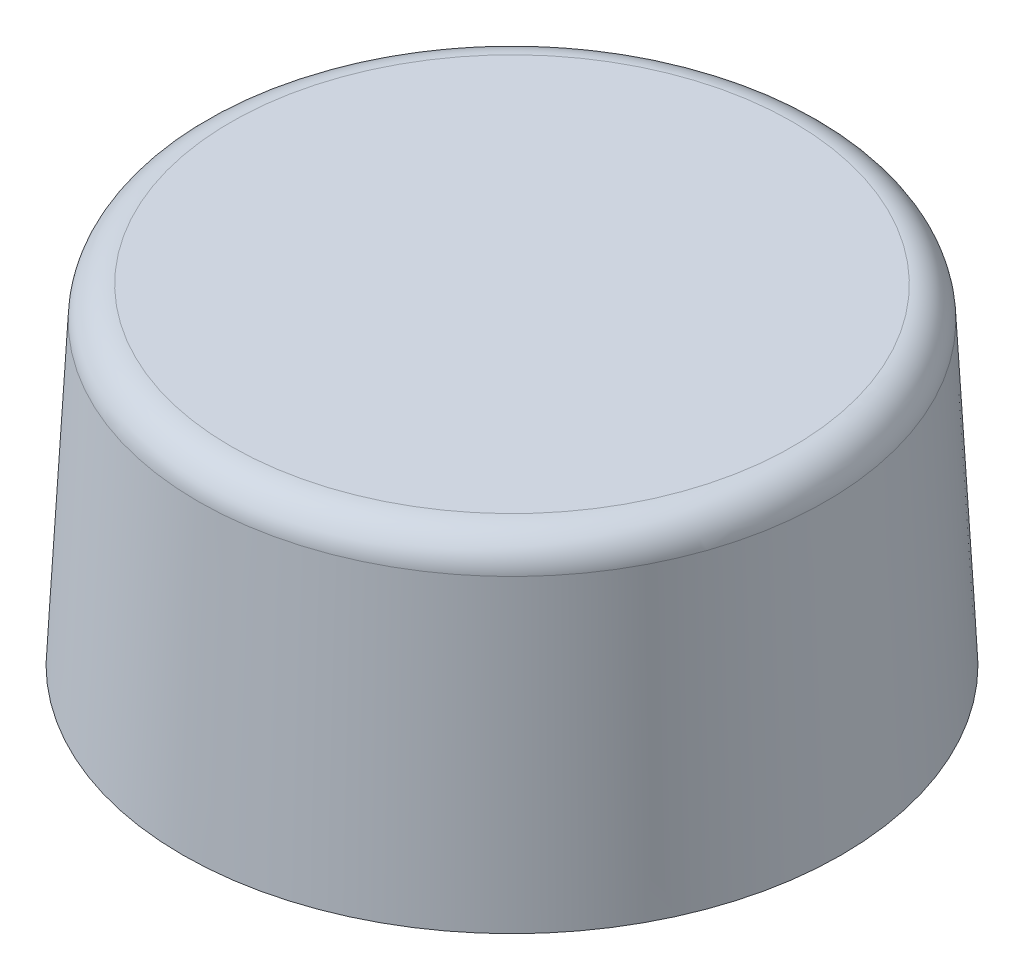
ISO-10303-21;
HEADER;
FILE_DESCRIPTION(('STEP AP214'),'2;1');
FILE_NAME('part.step','',(''),(''),'','','');
FILE_SCHEMA(('AUTOMOTIVE_DESIGN { 1 0 10303 214 1 1 1 1 }'));
ENDSEC;
DATA;
#1=APPLICATION_CONTEXT('core data for automotive mechanical design processes');
#2=APPLICATION_PROTOCOL_DEFINITION('international standard','automotive_design',2000,#1);
#3=PRODUCT_CONTEXT('',#1,'mechanical');
#4=PRODUCT('Part','Part','',(#3));
#5=PRODUCT_RELATED_PRODUCT_CATEGORY('part','',(#4));
#6=PRODUCT_DEFINITION_FORMATION('','',#4);
#7=PRODUCT_DEFINITION_CONTEXT('part definition',#1,'design');
#8=PRODUCT_DEFINITION('design','',#6,#7);
#9=PRODUCT_DEFINITION_SHAPE('','',#8);
#10=(LENGTH_UNIT() NAMED_UNIT(*) SI_UNIT(.MILLI.,.METRE.));
#11=(NAMED_UNIT(*) PLANE_ANGLE_UNIT() SI_UNIT($,.RADIAN.));
#12=(NAMED_UNIT(*) SI_UNIT($,.STERADIAN.) SOLID_ANGLE_UNIT());
#13=UNCERTAINTY_MEASURE_WITH_UNIT(LENGTH_MEASURE(1.E-05),#10,'distance_accuracy_value','');
#14=(GEOMETRIC_REPRESENTATION_CONTEXT(3) GLOBAL_UNCERTAINTY_ASSIGNED_CONTEXT((#13)) GLOBAL_UNIT_ASSIGNED_CONTEXT((#10,
#11,#12)) REPRESENTATION_CONTEXT('',''));
#15=CARTESIAN_POINT('',(0.,0.,0.));
#16=DIRECTION('',(0.,0.,1.));
#17=DIRECTION('',(1.,0.,0.));
#18=AXIS2_PLACEMENT_3D('',#15,#16,#17);
#19=CARTESIAN_POINT('',(0.,0.,0.));
#20=DIRECTION('',(0.,-1.,0.));
#21=DIRECTION('',(0.,0.,1.));
#22=AXIS2_PLACEMENT_3D('',#19,#20,#21);
#23=CONICAL_SURFACE('',#22,10.,0.05235987755983);
#24=CARTESIAN_POINT('',(0.,9.05233595624294,0.));
#25=DIRECTION('',(0.,-1.,0.));
#26=DIRECTION('',(0.,0.,-1.));
#27=AXIS2_PLACEMENT_3D('',#24,#25,#26);
#28=CIRCLE('',#27,9.52558717520928);
#29=CARTESIAN_POINT('',(0.,9.05233595624294,-9.52558717520928));
#30=VERTEX_POINT('',#29);
#31=EDGE_CURVE('E10',#30,#30,#28,.T.);
#32=ORIENTED_EDGE('',*,*,#31,.T.);
#33=EDGE_LOOP('',(#32));
#34=FACE_BOUND('',#33,.T.);
#35=CARTESIAN_POINT('',(0.,0.,0.));
#36=DIRECTION('',(0.,1.,0.));
#37=DIRECTION('',(0.,0.,1.));
#38=AXIS2_PLACEMENT_3D('',#35,#36,#37);
#39=CIRCLE('',#38,10.);
#40=CARTESIAN_POINT('',(0.,0.,10.));
#41=VERTEX_POINT('',#40);
#42=EDGE_CURVE('E46',#41,#41,#39,.T.);
#43=ORIENTED_EDGE('',*,*,#42,.T.);
#44=EDGE_LOOP('',(#43));
#45=FACE_BOUND('',#44,.T.);
#46=ADVANCED_FACE('F35',(#34,#45),#23,.T.);
#47=CARTESIAN_POINT('',(0.,10.,0.));
#48=DIRECTION('',(0.,1.,0.));
#49=DIRECTION('',(0.,0.,1.));
#50=AXIS2_PLACEMENT_3D('',#47,#48,#49);
#51=PLANE('',#50);
#52=CARTESIAN_POINT('',(0.,10.,0.));
#53=DIRECTION('',(0.,1.,0.));
#54=DIRECTION('',(0.,0.,1.));
#55=AXIS2_PLACEMENT_3D('',#52,#53,#54);
#56=CIRCLE('',#55,8.52695764045471);
#57=CARTESIAN_POINT('',(0.,10.,8.52695764045471));
#58=VERTEX_POINT('',#57);
#59=EDGE_CURVE('E42',#58,#58,#56,.T.);
#60=ORIENTED_EDGE('',*,*,#59,.T.);
#61=EDGE_LOOP('',(#60));
#62=FACE_BOUND('',#61,.T.);
#63=ADVANCED_FACE('F56',(#62),#51,.T.);
#64=CARTESIAN_POINT('',(0.,15.1666666666667,0.));
#65=DIRECTION('',(0.,0.,1.));
#66=DIRECTION('',(1.,0.,0.));
#67=AXIS2_PLACEMENT_3D('',#64,#65,#66);
#68=SPHERICAL_SURFACE('',#67,18.1666666666667);
#69=CARTESIAN_POINT('',(0.,15.1666666666667,0.));
#70=DIRECTION('',(0.,1.,0.));
#71=DIRECTION('',(0.,0.,1.));
#72=AXIS2_PLACEMENT_3D('',#69,#70,#71);
#73=SPHERICAL_SURFACE('',#72,18.1666666666667);
#74=ORIENTED_EDGE('',*,*,#42,.F.);
#75=EDGE_LOOP('',(#74));
#76=FACE_BOUND('',#75,.T.);
#77=ADVANCED_FACE('F54',(#76),#73,.T.);
#78=CARTESIAN_POINT('',(0.,9.,0.));
#79=DIRECTION('',(0.,1.,0.));
#80=DIRECTION('',(0.,0.,1.));
#81=AXIS2_PLACEMENT_3D('',#78,#79,#80);
#82=TOROIDAL_SURFACE('',#81,8.52695764045471,1.);
#83=ORIENTED_EDGE('',*,*,#31,.F.);
#84=EDGE_LOOP('',(#83));
#85=FACE_BOUND('',#84,.T.);
#86=ORIENTED_EDGE('',*,*,#59,.F.);
#87=EDGE_LOOP('',(#86));
#88=FACE_BOUND('',#87,.T.);
#89=ADVANCED_FACE('F37',(#85,#88),#82,.T.);
#90=CLOSED_SHELL('',(#46,#63,#77,#89));
#91=MANIFOLD_SOLID_BREP('B2',#90);
#92=ADVANCED_BREP_SHAPE_REPRESENTATION('',(#18,#91),#14);
#93=SHAPE_DEFINITION_REPRESENTATION(#9,#92);
ENDSEC;
END-ISO-10303-21;
